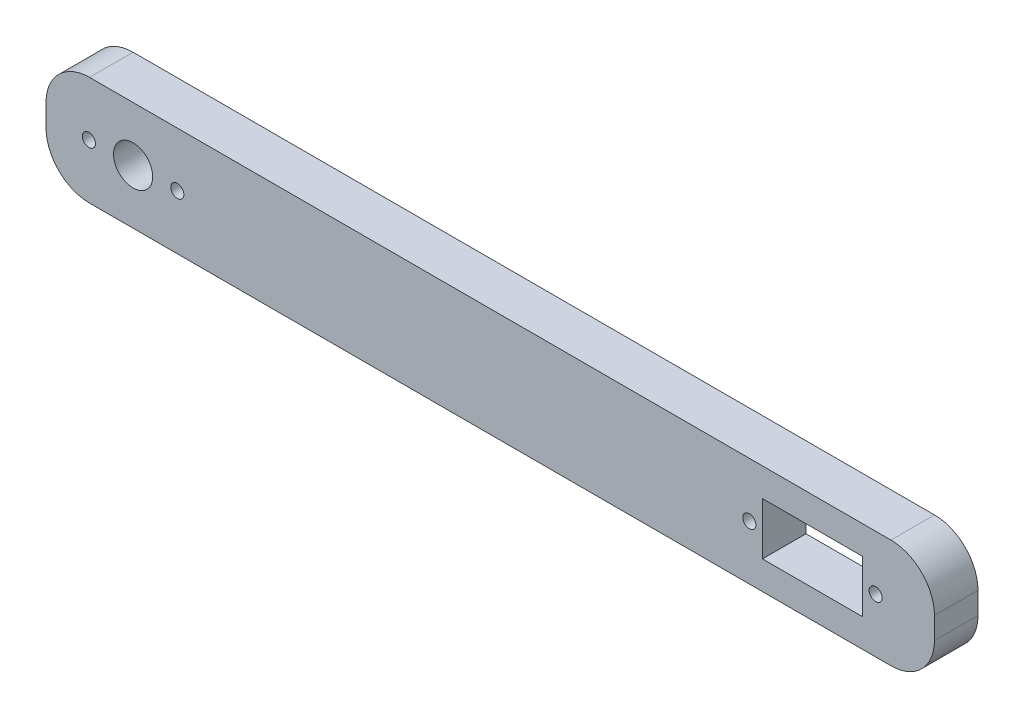
ISO-10303-21;
HEADER;
FILE_DESCRIPTION(('STEP AP214'),'2;1');
FILE_NAME('part.step','',(''),(''),'','','');
FILE_SCHEMA(('AUTOMOTIVE_DESIGN { 1 0 10303 214 1 1 1 1 }'));
ENDSEC;
DATA;
#1=APPLICATION_CONTEXT('core data for automotive mechanical design processes');
#2=APPLICATION_PROTOCOL_DEFINITION('international standard','automotive_design',2000,#1);
#3=PRODUCT_CONTEXT('',#1,'mechanical');
#4=PRODUCT('Part','Part','',(#3));
#5=PRODUCT_RELATED_PRODUCT_CATEGORY('part','',(#4));
#6=PRODUCT_DEFINITION_FORMATION('','',#4);
#7=PRODUCT_DEFINITION_CONTEXT('part definition',#1,'design');
#8=PRODUCT_DEFINITION('design','',#6,#7);
#9=PRODUCT_DEFINITION_SHAPE('','',#8);
#10=(LENGTH_UNIT() NAMED_UNIT(*) SI_UNIT(.MILLI.,.METRE.));
#11=(NAMED_UNIT(*) PLANE_ANGLE_UNIT() SI_UNIT($,.RADIAN.));
#12=(NAMED_UNIT(*) SI_UNIT($,.STERADIAN.) SOLID_ANGLE_UNIT());
#13=UNCERTAINTY_MEASURE_WITH_UNIT(LENGTH_MEASURE(1.E-05),#10,'distance_accuracy_value','');
#14=(GEOMETRIC_REPRESENTATION_CONTEXT(3) GLOBAL_UNCERTAINTY_ASSIGNED_CONTEXT((#13)) GLOBAL_UNIT_ASSIGNED_CONTEXT((#10,
#11,#12)) REPRESENTATION_CONTEXT('',''));
#15=CARTESIAN_POINT('',(0.,0.,0.));
#16=DIRECTION('',(0.,0.,1.));
#17=DIRECTION('',(1.,0.,0.));
#18=AXIS2_PLACEMENT_3D('',#15,#16,#17);
#19=CARTESIAN_POINT('',(-56.6607101183531,15.,10.));
#20=DIRECTION('',(0.,0.,-1.));
#21=DIRECTION('',(-1.,0.,0.));
#22=AXIS2_PLACEMENT_3D('',#19,#20,#21);
#23=CYLINDRICAL_SURFACE('',#22,10.);
#24=CARTESIAN_POINT('',(-56.6607101183531,15.,0.));
#25=DIRECTION('',(0.,0.,1.));
#26=DIRECTION('',(1.,0.,0.));
#27=AXIS2_PLACEMENT_3D('',#24,#25,#26);
#28=CIRCLE('',#27,10.);
#29=CARTESIAN_POINT('',(-66.6607101183531,14.9999999999999,0.));
#30=VERTEX_POINT('',#29);
#31=CARTESIAN_POINT('',(-56.660710118353,25.,0.));
#32=VERTEX_POINT('',#31);
#33=EDGE_CURVE('E207',#30,#32,#28,.F.);
#34=ORIENTED_EDGE('',*,*,#33,.F.);
#35=DIRECTION('',(0.,0.,-1.));
#36=VECTOR('',#35,1.);
#37=CARTESIAN_POINT('',(-66.6607101183531,14.9999999999999,10.));
#38=LINE('',#37,#36);
#39=CARTESIAN_POINT('',(-66.6607101183531,14.9999999999999,10.));
#40=VERTEX_POINT('',#39);
#41=EDGE_CURVE('E11',#40,#30,#38,.T.);
#42=ORIENTED_EDGE('',*,*,#41,.F.);
#43=CARTESIAN_POINT('',(-56.6607101183531,15.,10.));
#44=DIRECTION('',(0.,0.,1.));
#45=DIRECTION('',(1.,0.,0.));
#46=AXIS2_PLACEMENT_3D('',#43,#44,#45);
#47=CIRCLE('',#46,10.);
#48=CARTESIAN_POINT('',(-56.660710118353,25.,10.));
#49=VERTEX_POINT('',#48);
#50=EDGE_CURVE('E378',#40,#49,#47,.F.);
#51=ORIENTED_EDGE('',*,*,#50,.T.);
#52=DIRECTION('',(0.,0.,-1.));
#53=VECTOR('',#52,1.);
#54=CARTESIAN_POINT('',(-56.660710118353,25.,10.));
#55=LINE('',#54,#53);
#56=EDGE_CURVE('E59',#49,#32,#55,.T.);
#57=ORIENTED_EDGE('',*,*,#56,.T.);
#58=EDGE_LOOP('',(#34,#42,#51,#57));
#59=FACE_BOUND('',#58,.T.);
#60=ADVANCED_FACE('F39',(#59),#23,.T.);
#61=CARTESIAN_POINT('',(-66.6607101183532,3.70041276056299E-13,10.));
#62=DIRECTION('',(-1.,0.,0.));
#63=DIRECTION('',(0.,-1.,0.));
#64=AXIS2_PLACEMENT_3D('',#61,#62,#63);
#65=PLANE('',#64);
#66=DIRECTION('',(0.,1.,0.));
#67=VECTOR('',#66,1.);
#68=CARTESIAN_POINT('',(-66.6607101183532,3.70041276056299E-13,0.));
#69=LINE('',#68,#67);
#70=CARTESIAN_POINT('',(-66.6607101183531,9.99999999999999,0.));
#71=VERTEX_POINT('',#70);
#72=EDGE_CURVE('E210',#71,#30,#69,.T.);
#73=ORIENTED_EDGE('',*,*,#72,.F.);
#74=DIRECTION('',(0.,0.,-1.));
#75=VECTOR('',#74,1.);
#76=CARTESIAN_POINT('',(-66.6607101183531,9.99999999999999,10.));
#77=LINE('',#76,#75);
#78=CARTESIAN_POINT('',(-66.6607101183531,9.99999999999999,10.));
#79=VERTEX_POINT('',#78);
#80=EDGE_CURVE('E50',#79,#71,#77,.T.);
#81=ORIENTED_EDGE('',*,*,#80,.F.);
#82=DIRECTION('',(0.,1.,0.));
#83=VECTOR('',#82,1.);
#84=CARTESIAN_POINT('',(-66.6607101183532,3.70041276056299E-13,10.));
#85=LINE('',#84,#83);
#86=EDGE_CURVE('E372',#79,#40,#85,.T.);
#87=ORIENTED_EDGE('',*,*,#86,.T.);
#88=ORIENTED_EDGE('',*,*,#41,.T.);
#89=EDGE_LOOP('',(#73,#81,#87,#88));
#90=FACE_BOUND('',#89,.T.);
#91=ADVANCED_FACE('F304',(#90),#65,.T.);
#92=CARTESIAN_POINT('',(-56.6607101183531,9.99999999999999,10.));
#93=DIRECTION('',(0.,0.,-1.));
#94=DIRECTION('',(-1.,0.,0.));
#95=AXIS2_PLACEMENT_3D('',#92,#93,#94);
#96=CYLINDRICAL_SURFACE('',#95,10.);
#97=CARTESIAN_POINT('',(-56.6607101183531,9.99999999999999,0.));
#98=DIRECTION('',(0.,0.,1.));
#99=DIRECTION('',(1.,0.,0.));
#100=AXIS2_PLACEMENT_3D('',#97,#98,#99);
#101=CIRCLE('',#100,10.);
#102=CARTESIAN_POINT('',(-56.6607101183531,0.,0.));
#103=VERTEX_POINT('',#102);
#104=EDGE_CURVE('E214',#71,#103,#101,.T.);
#105=ORIENTED_EDGE('',*,*,#104,.T.);
#106=DIRECTION('',(0.,0.,-1.));
#107=VECTOR('',#106,1.);
#108=CARTESIAN_POINT('',(-56.6607101183531,0.,10.));
#109=LINE('',#108,#107);
#110=CARTESIAN_POINT('',(-56.6607101183531,0.,10.));
#111=VERTEX_POINT('',#110);
#112=EDGE_CURVE('E261',#111,#103,#109,.T.);
#113=ORIENTED_EDGE('',*,*,#112,.F.);
#114=CARTESIAN_POINT('',(-56.6607101183531,9.99999999999999,10.));
#115=DIRECTION('',(0.,0.,1.));
#116=DIRECTION('',(1.,0.,0.));
#117=AXIS2_PLACEMENT_3D('',#114,#115,#116);
#118=CIRCLE('',#117,10.);
#119=EDGE_CURVE('E368',#79,#111,#118,.T.);
#120=ORIENTED_EDGE('',*,*,#119,.F.);
#121=ORIENTED_EDGE('',*,*,#80,.T.);
#122=EDGE_LOOP('',(#105,#113,#120,#121));
#123=FACE_BOUND('',#122,.T.);
#124=ADVANCED_FACE('F309',(#123),#96,.T.);
#125=CARTESIAN_POINT('',(0.,0.,10.));
#126=DIRECTION('',(0.,-1.,0.));
#127=DIRECTION('',(1.,0.,0.));
#128=AXIS2_PLACEMENT_3D('',#125,#126,#127);
#129=PLANE('',#128);
#130=DIRECTION('',(-1.,0.,0.));
#131=VECTOR('',#130,1.);
#132=CARTESIAN_POINT('',(0.,0.,0.));
#133=LINE('',#132,#131);
#134=CARTESIAN_POINT('',(127.339289881647,0.,0.));
#135=VERTEX_POINT('',#134);
#136=EDGE_CURVE('E218',#135,#103,#133,.T.);
#137=ORIENTED_EDGE('',*,*,#136,.F.);
#138=DIRECTION('',(0.,0.,-1.));
#139=VECTOR('',#138,1.);
#140=CARTESIAN_POINT('',(127.339289881647,0.,10.));
#141=LINE('',#140,#139);
#142=CARTESIAN_POINT('',(127.339289881647,0.,10.));
#143=VERTEX_POINT('',#142);
#144=EDGE_CURVE('E258',#143,#135,#141,.T.);
#145=ORIENTED_EDGE('',*,*,#144,.F.);
#146=DIRECTION('',(-1.,0.,0.));
#147=VECTOR('',#146,1.);
#148=CARTESIAN_POINT('',(0.,0.,10.));
#149=LINE('',#148,#147);
#150=EDGE_CURVE('E366',#143,#111,#149,.T.);
#151=ORIENTED_EDGE('',*,*,#150,.T.);
#152=ORIENTED_EDGE('',*,*,#112,.T.);
#153=EDGE_LOOP('',(#137,#145,#151,#152));
#154=FACE_BOUND('',#153,.T.);
#155=ADVANCED_FACE('F349',(#154),#129,.T.);
#156=CARTESIAN_POINT('',(127.339289881647,10.,10.));
#157=DIRECTION('',(0.,0.,-1.));
#158=DIRECTION('',(-1.,0.,0.));
#159=AXIS2_PLACEMENT_3D('',#156,#157,#158);
#160=CYLINDRICAL_SURFACE('',#159,10.);
#161=CARTESIAN_POINT('',(127.339289881647,10.,0.));
#162=DIRECTION('',(0.,0.,1.));
#163=DIRECTION('',(1.,0.,0.));
#164=AXIS2_PLACEMENT_3D('',#161,#162,#163);
#165=CIRCLE('',#164,10.);
#166=CARTESIAN_POINT('',(137.339289881647,10.,0.));
#167=VERTEX_POINT('',#166);
#168=EDGE_CURVE('E222',#135,#167,#165,.T.);
#169=ORIENTED_EDGE('',*,*,#168,.T.);
#170=DIRECTION('',(0.,0.,-1.));
#171=VECTOR('',#170,1.);
#172=CARTESIAN_POINT('',(137.339289881647,10.,10.));
#173=LINE('',#172,#171);
#174=CARTESIAN_POINT('',(137.339289881647,10.,10.));
#175=VERTEX_POINT('',#174);
#176=EDGE_CURVE('E147',#175,#167,#173,.T.);
#177=ORIENTED_EDGE('',*,*,#176,.F.);
#178=CARTESIAN_POINT('',(127.339289881647,10.,10.));
#179=DIRECTION('',(0.,0.,1.));
#180=DIRECTION('',(1.,0.,0.));
#181=AXIS2_PLACEMENT_3D('',#178,#179,#180);
#182=CIRCLE('',#181,10.);
#183=EDGE_CURVE('E158',#143,#175,#182,.T.);
#184=ORIENTED_EDGE('',*,*,#183,.F.);
#185=ORIENTED_EDGE('',*,*,#144,.T.);
#186=EDGE_LOOP('',(#169,#177,#184,#185));
#187=FACE_BOUND('',#186,.T.);
#188=ADVANCED_FACE('F346',(#187),#160,.T.);
#189=CARTESIAN_POINT('',(137.339289881647,0.,10.));
#190=DIRECTION('',(1.,0.,0.));
#191=DIRECTION('',(0.,0.,-1.));
#192=AXIS2_PLACEMENT_3D('',#189,#190,#191);
#193=PLANE('',#192);
#194=DIRECTION('',(0.,-1.,0.));
#195=VECTOR('',#194,1.);
#196=CARTESIAN_POINT('',(137.339289881647,0.,0.));
#197=LINE('',#196,#195);
#198=CARTESIAN_POINT('',(137.339289881647,15.,0.));
#199=VERTEX_POINT('',#198);
#200=EDGE_CURVE('E142',#199,#167,#197,.T.);
#201=ORIENTED_EDGE('',*,*,#200,.F.);
#202=DIRECTION('',(0.,0.,-1.));
#203=VECTOR('',#202,1.);
#204=CARTESIAN_POINT('',(137.339289881647,15.,10.));
#205=LINE('',#204,#203);
#206=CARTESIAN_POINT('',(137.339289881647,15.,10.));
#207=VERTEX_POINT('',#206);
#208=EDGE_CURVE('E137',#207,#199,#205,.T.);
#209=ORIENTED_EDGE('',*,*,#208,.F.);
#210=DIRECTION('',(0.,-1.,0.));
#211=VECTOR('',#210,1.);
#212=CARTESIAN_POINT('',(137.339289881647,0.,10.));
#213=LINE('',#212,#211);
#214=EDGE_CURVE('E140',#207,#175,#213,.T.);
#215=ORIENTED_EDGE('',*,*,#214,.T.);
#216=ORIENTED_EDGE('',*,*,#176,.T.);
#217=EDGE_LOOP('',(#201,#209,#215,#216));
#218=FACE_BOUND('',#217,.T.);
#219=ADVANCED_FACE('F139',(#218),#193,.T.);
#220=CARTESIAN_POINT('',(127.339289881647,15.,10.));
#221=DIRECTION('',(0.,0.,-1.));
#222=DIRECTION('',(-1.,0.,0.));
#223=AXIS2_PLACEMENT_3D('',#220,#221,#222);
#224=CYLINDRICAL_SURFACE('',#223,10.);
#225=CARTESIAN_POINT('',(127.339289881647,15.,0.));
#226=DIRECTION('',(0.,0.,1.));
#227=DIRECTION('',(1.,0.,0.));
#228=AXIS2_PLACEMENT_3D('',#225,#226,#227);
#229=CIRCLE('',#228,10.);
#230=CARTESIAN_POINT('',(127.339289881647,25.,0.));
#231=VERTEX_POINT('',#230);
#232=EDGE_CURVE('E228',#231,#199,#229,.F.);
#233=ORIENTED_EDGE('',*,*,#232,.F.);
#234=DIRECTION('',(0.,0.,-1.));
#235=VECTOR('',#234,1.);
#236=CARTESIAN_POINT('',(127.339289881647,25.,10.));
#237=LINE('',#236,#235);
#238=CARTESIAN_POINT('',(127.339289881647,25.,10.));
#239=VERTEX_POINT('',#238);
#240=EDGE_CURVE('E96',#239,#231,#237,.T.);
#241=ORIENTED_EDGE('',*,*,#240,.F.);
#242=CARTESIAN_POINT('',(127.339289881647,15.,10.));
#243=DIRECTION('',(0.,0.,1.));
#244=DIRECTION('',(1.,0.,0.));
#245=AXIS2_PLACEMENT_3D('',#242,#243,#244);
#246=CIRCLE('',#245,10.);
#247=EDGE_CURVE('E155',#239,#207,#246,.F.);
#248=ORIENTED_EDGE('',*,*,#247,.T.);
#249=ORIENTED_EDGE('',*,*,#208,.T.);
#250=EDGE_LOOP('',(#233,#241,#248,#249));
#251=FACE_BOUND('',#250,.T.);
#252=ADVANCED_FACE('F162',(#251),#224,.T.);
#253=CARTESIAN_POINT('',(0.,6.49999999999998,10.));
#254=DIRECTION('',(0.,-1.,0.));
#255=DIRECTION('',(1.,0.,0.));
#256=AXIS2_PLACEMENT_3D('',#253,#254,#255);
#257=PLANE('',#256);
#258=DIRECTION('',(-1.,0.,0.));
#259=VECTOR('',#258,1.);
#260=CARTESIAN_POINT('',(0.,6.49999999999998,0.));
#261=LINE('',#260,#259);
#262=CARTESIAN_POINT('',(120.839289881647,6.5,0.));
#263=VERTEX_POINT('',#262);
#264=CARTESIAN_POINT('',(97.8392898816469,6.49999999999999,0.));
#265=VERTEX_POINT('',#264);
#266=EDGE_CURVE('E187',#263,#265,#261,.T.);
#267=ORIENTED_EDGE('',*,*,#266,.T.);
#268=DIRECTION('',(0.,0.,-1.));
#269=VECTOR('',#268,1.);
#270=CARTESIAN_POINT('',(97.8392898816469,6.49999999999999,10.));
#271=LINE('',#270,#269);
#272=CARTESIAN_POINT('',(97.8392898816469,6.49999999999999,10.));
#273=VERTEX_POINT('',#272);
#274=EDGE_CURVE('E43',#273,#265,#271,.T.);
#275=ORIENTED_EDGE('',*,*,#274,.F.);
#276=DIRECTION('',(-1.,0.,0.));
#277=VECTOR('',#276,1.);
#278=CARTESIAN_POINT('',(0.,6.49999999999998,10.));
#279=LINE('',#278,#277);
#280=CARTESIAN_POINT('',(120.839289881647,6.5,10.));
#281=VERTEX_POINT('',#280);
#282=EDGE_CURVE('E251',#281,#273,#279,.T.);
#283=ORIENTED_EDGE('',*,*,#282,.F.);
#284=DIRECTION('',(0.,0.,-1.));
#285=VECTOR('',#284,1.);
#286=CARTESIAN_POINT('',(120.839289881647,6.5,10.));
#287=LINE('',#286,#285);
#288=EDGE_CURVE('E186',#281,#263,#287,.T.);
#289=ORIENTED_EDGE('',*,*,#288,.T.);
#290=EDGE_LOOP('',(#267,#275,#283,#289));
#291=FACE_BOUND('',#290,.T.);
#292=ADVANCED_FACE('F41',(#291),#257,.F.);
#293=CARTESIAN_POINT('',(97.8392898816469,0.,10.));
#294=DIRECTION('',(-1.,0.,0.));
#295=DIRECTION('',(0.,0.,1.));
#296=AXIS2_PLACEMENT_3D('',#293,#294,#295);
#297=PLANE('',#296);
#298=DIRECTION('',(0.,1.,0.));
#299=VECTOR('',#298,1.);
#300=CARTESIAN_POINT('',(97.8392898816469,0.,0.));
#301=LINE('',#300,#299);
#302=CARTESIAN_POINT('',(97.8392898816469,18.5,0.));
#303=VERTEX_POINT('',#302);
#304=EDGE_CURVE('E191',#265,#303,#301,.T.);
#305=ORIENTED_EDGE('',*,*,#304,.T.);
#306=DIRECTION('',(0.,0.,-1.));
#307=VECTOR('',#306,1.);
#308=CARTESIAN_POINT('',(97.8392898816469,18.5,10.));
#309=LINE('',#308,#307);
#310=CARTESIAN_POINT('',(97.8392898816469,18.5,10.));
#311=VERTEX_POINT('',#310);
#312=EDGE_CURVE('E270',#311,#303,#309,.T.);
#313=ORIENTED_EDGE('',*,*,#312,.F.);
#314=DIRECTION('',(0.,1.,0.));
#315=VECTOR('',#314,1.);
#316=CARTESIAN_POINT('',(97.8392898816469,0.,10.));
#317=LINE('',#316,#315);
#318=EDGE_CURVE('E109',#273,#311,#317,.T.);
#319=ORIENTED_EDGE('',*,*,#318,.F.);
#320=ORIENTED_EDGE('',*,*,#274,.T.);
#321=EDGE_LOOP('',(#305,#313,#319,#320));
#322=FACE_BOUND('',#321,.T.);
#323=ADVANCED_FACE('F277',(#322),#297,.F.);
#324=CARTESIAN_POINT('',(0.,18.5,10.));
#325=DIRECTION('',(0.,-1.,0.));
#326=DIRECTION('',(1.,0.,0.));
#327=AXIS2_PLACEMENT_3D('',#324,#325,#326);
#328=PLANE('',#327);
#329=DIRECTION('',(-1.,0.,0.));
#330=VECTOR('',#329,1.);
#331=CARTESIAN_POINT('',(0.,18.5,0.));
#332=LINE('',#331,#330);
#333=CARTESIAN_POINT('',(120.839289881647,18.5,0.));
#334=VERTEX_POINT('',#333);
#335=EDGE_CURVE('E195',#334,#303,#332,.T.);
#336=ORIENTED_EDGE('',*,*,#335,.F.);
#337=DIRECTION('',(0.,0.,-1.));
#338=VECTOR('',#337,1.);
#339=CARTESIAN_POINT('',(120.839289881647,18.5,10.));
#340=LINE('',#339,#338);
#341=CARTESIAN_POINT('',(120.839289881647,18.5,10.));
#342=VERTEX_POINT('',#341);
#343=EDGE_CURVE('E268',#342,#334,#340,.T.);
#344=ORIENTED_EDGE('',*,*,#343,.F.);
#345=DIRECTION('',(-1.,0.,0.));
#346=VECTOR('',#345,1.);
#347=CARTESIAN_POINT('',(0.,18.5,10.));
#348=LINE('',#347,#346);
#349=EDGE_CURVE('E387',#342,#311,#348,.T.);
#350=ORIENTED_EDGE('',*,*,#349,.T.);
#351=ORIENTED_EDGE('',*,*,#312,.T.);
#352=EDGE_LOOP('',(#336,#344,#350,#351));
#353=FACE_BOUND('',#352,.T.);
#354=ADVANCED_FACE('F291',(#353),#328,.T.);
#355=CARTESIAN_POINT('',(-36.5107101183531,12.5,10.));
#356=DIRECTION('',(0.,0.,-1.));
#357=DIRECTION('',(-1.,0.,0.));
#358=AXIS2_PLACEMENT_3D('',#355,#356,#357);
#359=CYLINDRICAL_SURFACE('',#358,1.5);
#360=CARTESIAN_POINT('',(-36.5107101183531,12.5,10.));
#361=DIRECTION('',(0.,0.,1.));
#362=DIRECTION('',(1.,0.,0.));
#363=AXIS2_PLACEMENT_3D('',#360,#361,#362);
#364=CIRCLE('',#363,1.5);
#365=CARTESIAN_POINT('',(-35.0107101183531,12.5,10.));
#366=VERTEX_POINT('',#365);
#367=EDGE_CURVE('E178',#366,#366,#364,.T.);
#368=ORIENTED_EDGE('',*,*,#367,.T.);
#369=EDGE_LOOP('',(#368));
#370=FACE_BOUND('',#369,.T.);
#371=CARTESIAN_POINT('',(-36.5107101183531,12.5,0.));
#372=DIRECTION('',(0.,0.,1.));
#373=DIRECTION('',(1.,0.,0.));
#374=AXIS2_PLACEMENT_3D('',#371,#372,#373);
#375=CIRCLE('',#374,1.5);
#376=CARTESIAN_POINT('',(-35.0107101183531,12.5,0.));
#377=VERTEX_POINT('',#376);
#378=EDGE_CURVE('E243',#377,#377,#375,.T.);
#379=ORIENTED_EDGE('',*,*,#378,.F.);
#380=EDGE_LOOP('',(#379));
#381=FACE_BOUND('',#380,.T.);
#382=ADVANCED_FACE('F293',(#370,#381),#359,.F.);
#383=CARTESIAN_POINT('',(-56.8107101183531,12.5,10.));
#384=DIRECTION('',(0.,0.,-1.));
#385=DIRECTION('',(-1.,0.,0.));
#386=AXIS2_PLACEMENT_3D('',#383,#384,#385);
#387=CYLINDRICAL_SURFACE('',#386,1.5);
#388=CARTESIAN_POINT('',(-56.8107101183531,12.5,10.));
#389=DIRECTION('',(0.,0.,1.));
#390=DIRECTION('',(1.,0.,0.));
#391=AXIS2_PLACEMENT_3D('',#388,#389,#390);
#392=CIRCLE('',#391,1.5);
#393=CARTESIAN_POINT('',(-55.3107101183531,12.5,10.));
#394=VERTEX_POINT('',#393);
#395=EDGE_CURVE('E174',#394,#394,#392,.T.);
#396=ORIENTED_EDGE('',*,*,#395,.T.);
#397=EDGE_LOOP('',(#396));
#398=FACE_BOUND('',#397,.T.);
#399=CARTESIAN_POINT('',(-56.8107101183531,12.5,0.));
#400=DIRECTION('',(0.,0.,1.));
#401=DIRECTION('',(1.,0.,0.));
#402=AXIS2_PLACEMENT_3D('',#399,#400,#401);
#403=CIRCLE('',#402,1.5);
#404=CARTESIAN_POINT('',(-55.3107101183531,12.5,0.));
#405=VERTEX_POINT('',#404);
#406=EDGE_CURVE('E239',#405,#405,#403,.T.);
#407=ORIENTED_EDGE('',*,*,#406,.F.);
#408=EDGE_LOOP('',(#407));
#409=FACE_BOUND('',#408,.T.);
#410=ADVANCED_FACE('F299',(#398,#409),#387,.F.);
#411=CARTESIAN_POINT('',(94.8392898816469,12.5,10.));
#412=DIRECTION('',(0.,0.,-1.));
#413=DIRECTION('',(-1.,0.,0.));
#414=AXIS2_PLACEMENT_3D('',#411,#412,#413);
#415=CYLINDRICAL_SURFACE('',#414,1.5);
#416=CARTESIAN_POINT('',(94.8392898816469,12.5,10.));
#417=DIRECTION('',(0.,0.,1.));
#418=DIRECTION('',(1.,0.,0.));
#419=AXIS2_PLACEMENT_3D('',#416,#417,#418);
#420=CIRCLE('',#419,1.5);
#421=CARTESIAN_POINT('',(96.3392898816469,12.5,10.));
#422=VERTEX_POINT('',#421);
#423=EDGE_CURVE('E167',#422,#422,#420,.T.);
#424=ORIENTED_EDGE('',*,*,#423,.T.);
#425=EDGE_LOOP('',(#424));
#426=FACE_BOUND('',#425,.T.);
#427=CARTESIAN_POINT('',(94.8392898816469,12.5,0.));
#428=DIRECTION('',(0.,0.,1.));
#429=DIRECTION('',(1.,0.,0.));
#430=AXIS2_PLACEMENT_3D('',#427,#428,#429);
#431=CIRCLE('',#430,1.5);
#432=CARTESIAN_POINT('',(96.3392898816469,12.5,0.));
#433=VERTEX_POINT('',#432);
#434=EDGE_CURVE('E235',#433,#433,#431,.T.);
#435=ORIENTED_EDGE('',*,*,#434,.F.);
#436=EDGE_LOOP('',(#435));
#437=FACE_BOUND('',#436,.T.);
#438=ADVANCED_FACE('F335',(#426,#437),#415,.F.);
#439=CARTESIAN_POINT('',(0.,25.,10.));
#440=DIRECTION('',(0.,1.,0.));
#441=DIRECTION('',(-1.,0.,0.));
#442=AXIS2_PLACEMENT_3D('',#439,#440,#441);
#443=PLANE('',#442);
#444=DIRECTION('',(1.,0.,0.));
#445=VECTOR('',#444,1.);
#446=CARTESIAN_POINT('',(0.,25.,0.));
#447=LINE('',#446,#445);
#448=EDGE_CURVE('E231',#32,#231,#447,.T.);
#449=ORIENTED_EDGE('',*,*,#448,.F.);
#450=ORIENTED_EDGE('',*,*,#56,.F.);
#451=DIRECTION('',(1.,0.,0.));
#452=VECTOR('',#451,1.);
#453=CARTESIAN_POINT('',(0.,25.,10.));
#454=LINE('',#453,#452);
#455=EDGE_CURVE('E164',#49,#239,#454,.T.);
#456=ORIENTED_EDGE('',*,*,#455,.T.);
#457=ORIENTED_EDGE('',*,*,#240,.T.);
#458=EDGE_LOOP('',(#449,#450,#456,#457));
#459=FACE_BOUND('',#458,.T.);
#460=ADVANCED_FACE('F316',(#459),#443,.T.);
#461=CARTESIAN_POINT('',(123.839289881647,12.5,10.));
#462=DIRECTION('',(0.,0.,-1.));
#463=DIRECTION('',(-1.,0.,0.));
#464=AXIS2_PLACEMENT_3D('',#461,#462,#463);
#465=CYLINDRICAL_SURFACE('',#464,1.5);
#466=CARTESIAN_POINT('',(123.839289881647,12.5,10.));
#467=DIRECTION('',(0.,0.,1.));
#468=DIRECTION('',(1.,0.,0.));
#469=AXIS2_PLACEMENT_3D('',#466,#467,#468);
#470=CIRCLE('',#469,1.5);
#471=CARTESIAN_POINT('',(125.339289881647,12.5,10.));
#472=VERTEX_POINT('',#471);
#473=EDGE_CURVE('E381',#472,#472,#470,.T.);
#474=ORIENTED_EDGE('',*,*,#473,.T.);
#475=EDGE_LOOP('',(#474));
#476=FACE_BOUND('',#475,.T.);
#477=CARTESIAN_POINT('',(123.839289881647,12.5,0.));
#478=DIRECTION('',(0.,0.,1.));
#479=DIRECTION('',(1.,0.,0.));
#480=AXIS2_PLACEMENT_3D('',#477,#478,#479);
#481=CIRCLE('',#480,1.5);
#482=CARTESIAN_POINT('',(125.339289881647,12.5,0.));
#483=VERTEX_POINT('',#482);
#484=EDGE_CURVE('E203',#483,#483,#481,.T.);
#485=ORIENTED_EDGE('',*,*,#484,.F.);
#486=EDGE_LOOP('',(#485));
#487=FACE_BOUND('',#486,.T.);
#488=ADVANCED_FACE('F314',(#476,#487),#465,.F.);
#489=CARTESIAN_POINT('',(120.839289881647,0.,10.));
#490=DIRECTION('',(-1.,0.,0.));
#491=DIRECTION('',(0.,0.,1.));
#492=AXIS2_PLACEMENT_3D('',#489,#490,#491);
#493=PLANE('',#492);
#494=DIRECTION('',(0.,1.,0.));
#495=VECTOR('',#494,1.);
#496=CARTESIAN_POINT('',(120.839289881647,0.,0.));
#497=LINE('',#496,#495);
#498=EDGE_CURVE('E199',#263,#334,#497,.T.);
#499=ORIENTED_EDGE('',*,*,#498,.F.);
#500=ORIENTED_EDGE('',*,*,#288,.F.);
#501=DIRECTION('',(0.,1.,0.));
#502=VECTOR('',#501,1.);
#503=CARTESIAN_POINT('',(120.839289881647,0.,10.));
#504=LINE('',#503,#502);
#505=EDGE_CURVE('E289',#281,#342,#504,.T.);
#506=ORIENTED_EDGE('',*,*,#505,.T.);
#507=ORIENTED_EDGE('',*,*,#343,.T.);
#508=EDGE_LOOP('',(#499,#500,#506,#507));
#509=FACE_BOUND('',#508,.T.);
#510=ADVANCED_FACE('F286',(#509),#493,.T.);
#511=CARTESIAN_POINT('',(-46.6607101183531,12.5,10.));
#512=DIRECTION('',(0.,0.,-1.));
#513=DIRECTION('',(-1.,0.,0.));
#514=AXIS2_PLACEMENT_3D('',#511,#512,#513);
#515=CYLINDRICAL_SURFACE('',#514,4.5);
#516=CARTESIAN_POINT('',(-46.6607101183531,12.5,10.));
#517=DIRECTION('',(0.,0.,1.));
#518=DIRECTION('',(1.,0.,0.));
#519=AXIS2_PLACEMENT_3D('',#516,#517,#518);
#520=CIRCLE('',#519,4.5);
#521=CARTESIAN_POINT('',(-42.1607101183531,12.5,10.));
#522=VERTEX_POINT('',#521);
#523=EDGE_CURVE('E182',#522,#522,#520,.T.);
#524=ORIENTED_EDGE('',*,*,#523,.T.);
#525=EDGE_LOOP('',(#524));
#526=FACE_BOUND('',#525,.T.);
#527=CARTESIAN_POINT('',(-46.6607101183531,12.5,0.));
#528=DIRECTION('',(0.,0.,1.));
#529=DIRECTION('',(1.,0.,0.));
#530=AXIS2_PLACEMENT_3D('',#527,#528,#529);
#531=CIRCLE('',#530,4.5);
#532=CARTESIAN_POINT('',(-42.1607101183531,12.5,0.));
#533=VERTEX_POINT('',#532);
#534=EDGE_CURVE('E247',#533,#533,#531,.T.);
#535=ORIENTED_EDGE('',*,*,#534,.F.);
#536=EDGE_LOOP('',(#535));
#537=FACE_BOUND('',#536,.T.);
#538=ADVANCED_FACE('F319',(#526,#537),#515,.F.);
#539=CARTESIAN_POINT('',(0.,0.,10.));
#540=DIRECTION('',(0.,0.,1.));
#541=DIRECTION('',(1.,0.,0.));
#542=AXIS2_PLACEMENT_3D('',#539,#540,#541);
#543=PLANE('',#542);
#544=ORIENTED_EDGE('',*,*,#282,.T.);
#545=ORIENTED_EDGE('',*,*,#318,.T.);
#546=ORIENTED_EDGE('',*,*,#349,.F.);
#547=ORIENTED_EDGE('',*,*,#505,.F.);
#548=EDGE_LOOP('',(#544,#545,#546,#547));
#549=FACE_BOUND('',#548,.T.);
#550=ORIENTED_EDGE('',*,*,#473,.F.);
#551=EDGE_LOOP('',(#550));
#552=FACE_BOUND('',#551,.T.);
#553=ORIENTED_EDGE('',*,*,#50,.F.);
#554=ORIENTED_EDGE('',*,*,#86,.F.);
#555=ORIENTED_EDGE('',*,*,#119,.T.);
#556=ORIENTED_EDGE('',*,*,#150,.F.);
#557=ORIENTED_EDGE('',*,*,#183,.T.);
#558=ORIENTED_EDGE('',*,*,#214,.F.);
#559=ORIENTED_EDGE('',*,*,#247,.F.);
#560=ORIENTED_EDGE('',*,*,#455,.F.);
#561=EDGE_LOOP('',(#553,#554,#555,#556,#557,#558,#559,#560));
#562=FACE_BOUND('',#561,.T.);
#563=ORIENTED_EDGE('',*,*,#423,.F.);
#564=EDGE_LOOP('',(#563));
#565=FACE_BOUND('',#564,.T.);
#566=ORIENTED_EDGE('',*,*,#395,.F.);
#567=EDGE_LOOP('',(#566));
#568=FACE_BOUND('',#567,.T.);
#569=ORIENTED_EDGE('',*,*,#367,.F.);
#570=EDGE_LOOP('',(#569));
#571=FACE_BOUND('',#570,.T.);
#572=ORIENTED_EDGE('',*,*,#523,.F.);
#573=EDGE_LOOP('',(#572));
#574=FACE_BOUND('',#573,.T.);
#575=ADVANCED_FACE('F152',(#549,#552,#562,#565,#568,#571,#574),#543,.T.);
#576=CARTESIAN_POINT('',(0.,0.,0.));
#577=DIRECTION('',(0.,0.,1.));
#578=DIRECTION('',(1.,0.,0.));
#579=AXIS2_PLACEMENT_3D('',#576,#577,#578);
#580=PLANE('',#579);
#581=ORIENTED_EDGE('',*,*,#266,.F.);
#582=ORIENTED_EDGE('',*,*,#498,.T.);
#583=ORIENTED_EDGE('',*,*,#335,.T.);
#584=ORIENTED_EDGE('',*,*,#304,.F.);
#585=EDGE_LOOP('',(#581,#582,#583,#584));
#586=FACE_BOUND('',#585,.T.);
#587=ORIENTED_EDGE('',*,*,#484,.T.);
#588=EDGE_LOOP('',(#587));
#589=FACE_BOUND('',#588,.T.);
#590=ORIENTED_EDGE('',*,*,#33,.T.);
#591=ORIENTED_EDGE('',*,*,#448,.T.);
#592=ORIENTED_EDGE('',*,*,#232,.T.);
#593=ORIENTED_EDGE('',*,*,#200,.T.);
#594=ORIENTED_EDGE('',*,*,#168,.F.);
#595=ORIENTED_EDGE('',*,*,#136,.T.);
#596=ORIENTED_EDGE('',*,*,#104,.F.);
#597=ORIENTED_EDGE('',*,*,#72,.T.);
#598=EDGE_LOOP('',(#590,#591,#592,#593,#594,#595,#596,#597));
#599=FACE_BOUND('',#598,.T.);
#600=ORIENTED_EDGE('',*,*,#434,.T.);
#601=EDGE_LOOP('',(#600));
#602=FACE_BOUND('',#601,.T.);
#603=ORIENTED_EDGE('',*,*,#406,.T.);
#604=EDGE_LOOP('',(#603));
#605=FACE_BOUND('',#604,.T.);
#606=ORIENTED_EDGE('',*,*,#378,.T.);
#607=EDGE_LOOP('',(#606));
#608=FACE_BOUND('',#607,.T.);
#609=ORIENTED_EDGE('',*,*,#534,.T.);
#610=EDGE_LOOP('',(#609));
#611=FACE_BOUND('',#610,.T.);
#612=ADVANCED_FACE('F283',(#586,#589,#599,#602,#605,#608,#611),#580,.F.);
#613=CLOSED_SHELL('',(#60,#91,#124,#155,#188,#219,#252,#292,#323,#354,#382,#410,#438,#460,#488,
#510,#538,#575,#612));
#614=MANIFOLD_SOLID_BREP('B2',#613);
#615=ADVANCED_BREP_SHAPE_REPRESENTATION('',(#18,#614),#14);
#616=SHAPE_DEFINITION_REPRESENTATION(#9,#615);
ENDSEC;
END-ISO-10303-21;
